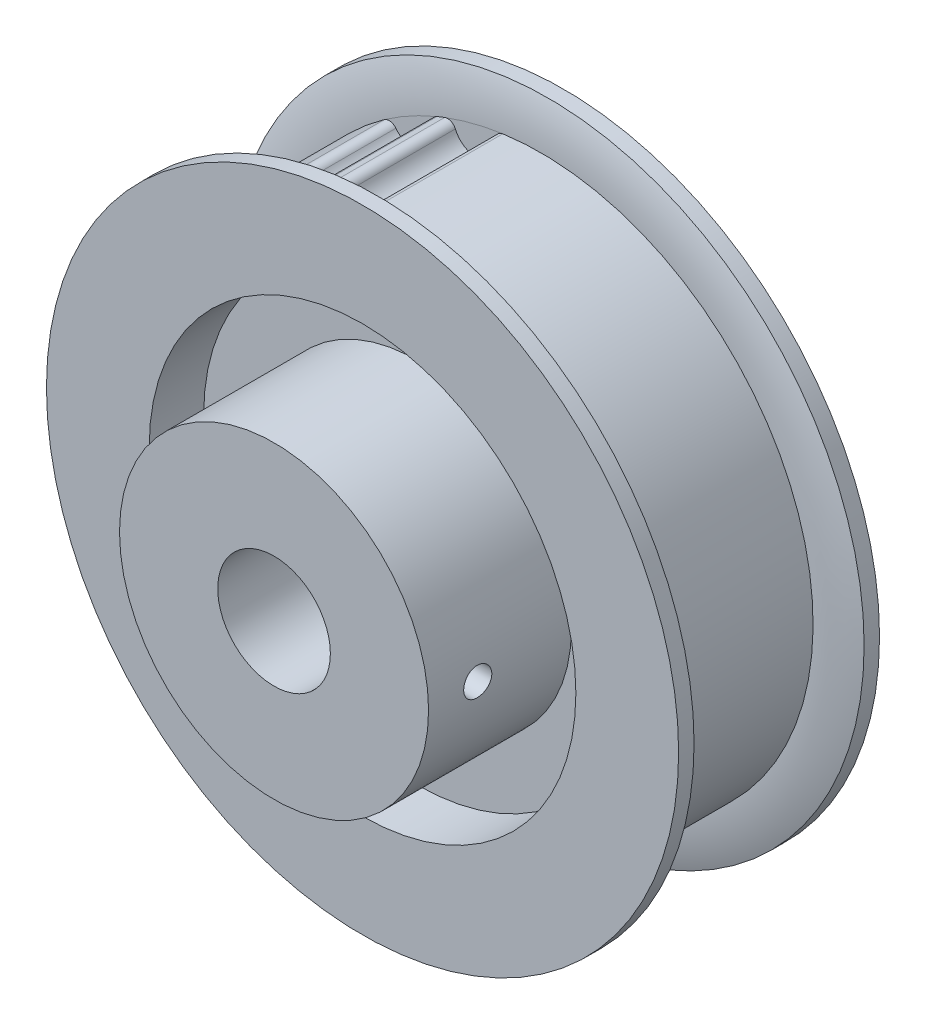
ISO-10303-21;
HEADER;
FILE_DESCRIPTION(('STEP AP214'),'2;1');
FILE_NAME('part.step','',(''),(''),'','','');
FILE_SCHEMA(('AUTOMOTIVE_DESIGN { 1 0 10303 214 1 1 1 1 }'));
ENDSEC;
DATA;
#1=APPLICATION_CONTEXT('core data for automotive mechanical design processes');
#2=APPLICATION_PROTOCOL_DEFINITION('international standard','automotive_design',2000,#1);
#3=PRODUCT_CONTEXT('',#1,'mechanical');
#4=PRODUCT('Part','Part','',(#3));
#5=PRODUCT_RELATED_PRODUCT_CATEGORY('part','',(#4));
#6=PRODUCT_DEFINITION_FORMATION('','',#4);
#7=PRODUCT_DEFINITION_CONTEXT('part definition',#1,'design');
#8=PRODUCT_DEFINITION('design','',#6,#7);
#9=PRODUCT_DEFINITION_SHAPE('','',#8);
#10=(LENGTH_UNIT() NAMED_UNIT(*) SI_UNIT(.MILLI.,.METRE.));
#11=(NAMED_UNIT(*) PLANE_ANGLE_UNIT() SI_UNIT($,.RADIAN.));
#12=(NAMED_UNIT(*) SI_UNIT($,.STERADIAN.) SOLID_ANGLE_UNIT());
#13=UNCERTAINTY_MEASURE_WITH_UNIT(LENGTH_MEASURE(1.E-05),#10,'distance_accuracy_value','');
#14=(GEOMETRIC_REPRESENTATION_CONTEXT(3) GLOBAL_UNCERTAINTY_ASSIGNED_CONTEXT((#13)) GLOBAL_UNIT_ASSIGNED_CONTEXT((#10,
#11,#12)) REPRESENTATION_CONTEXT('',''));
#15=CARTESIAN_POINT('',(0.,0.,0.));
#16=DIRECTION('',(0.,0.,1.));
#17=DIRECTION('',(1.,0.,0.));
#18=AXIS2_PLACEMENT_3D('',#15,#16,#17);
#19=CARTESIAN_POINT('',(0.,0.,-8.18));
#20=DIRECTION('',(0.,0.,1.));
#21=DIRECTION('',(1.,0.,0.));
#22=AXIS2_PLACEMENT_3D('',#19,#20,#21);
#23=CYLINDRICAL_SURFACE('',#22,4.009);
#24=CARTESIAN_POINT('',(0.,0.,-7.15));
#25=DIRECTION('',(0.,0.,1.));
#26=DIRECTION('',(1.,0.,0.));
#27=AXIS2_PLACEMENT_3D('',#24,#25,#26);
#28=CIRCLE('',#27,4.009);
#29=CARTESIAN_POINT('',(4.009,0.,-7.15));
#30=VERTEX_POINT('',#29);
#31=EDGE_CURVE('E20',#30,#30,#28,.F.);
#32=ORIENTED_EDGE('',*,*,#31,.T.);
#33=EDGE_LOOP('',(#32));
#34=FACE_BOUND('',#33,.T.);
#35=CARTESIAN_POINT('',(0.,0.,13.45));
#36=DIRECTION('',(0.,0.,1.));
#37=DIRECTION('',(1.,0.,0.));
#38=AXIS2_PLACEMENT_3D('',#35,#36,#37);
#39=CIRCLE('',#38,4.009);
#40=CARTESIAN_POINT('',(4.009,0.,13.45));
#41=VERTEX_POINT('',#40);
#42=EDGE_CURVE('E632',#41,#41,#39,.F.);
#43=ORIENTED_EDGE('',*,*,#42,.F.);
#44=EDGE_LOOP('',(#43));
#45=FACE_BOUND('',#44,.T.);
#46=CARTESIAN_POINT('',(4.009,0.,8.95));
#47=CARTESIAN_POINT('',(4.00899836550372,0.0551908520962204,8.95000282063457));
#48=CARTESIAN_POINT('',(4.00784763630519,0.110446653160701,8.95458927477763));
#49=CARTESIAN_POINT('',(4.00336384291525,0.219424046419387,8.97280195709089));
#50=CARTESIAN_POINT('',(4.00002666739113,0.273142548917412,8.98644521606377));
#51=CARTESIAN_POINT('',(3.99154021932719,0.377382395400712,9.02230722988224));
#52=CARTESIAN_POINT('',(3.98639404761028,0.42790903685331,9.04451131677123));
#53=CARTESIAN_POINT('',(3.97483915708241,0.524503614591403,9.09682153429381));
#54=CARTESIAN_POINT('',(3.96843076586231,0.570572703153768,9.12692561527033));
#55=CARTESIAN_POINT('',(3.95489840687399,0.657913993002216,9.19484073397902));
#56=CARTESIAN_POINT('',(3.9477633788263,0.69908147553429,9.23278425935317));
#57=CARTESIAN_POINT('',(3.93365522236764,0.774541554751383,9.31501931822153));
#58=CARTESIAN_POINT('',(3.92668212120812,0.808833001544661,9.35931191136136));
#59=CARTESIAN_POINT('',(3.91357717848517,0.870053064064385,9.45379240236042));
#60=CARTESIAN_POINT('',(3.90745927067669,0.896865552786396,9.50405765501213));
#61=CARTESIAN_POINT('',(3.89691749378886,0.941619508791967,9.60855890675831));
#62=CARTESIAN_POINT('',(3.89249334209781,0.959562456148547,9.66279424162416));
#63=CARTESIAN_POINT('',(3.88595285639913,0.985713549545539,9.77255259938645));
#64=CARTESIAN_POINT('',(3.88379225011952,0.994108730242365,9.82802835984838));
#65=CARTESIAN_POINT('',(3.881890961187,1.00150853719121,9.93963977605675));
#66=CARTESIAN_POINT('',(3.88214988966197,1.00051467246775,9.99577532431244));
#67=CARTESIAN_POINT('',(3.88501860770972,0.98931387699709,10.1056796612486));
#68=CARTESIAN_POINT('',(3.88757153316411,0.979329785578443,10.1594728763976));
#69=CARTESIAN_POINT('',(3.89465001309003,0.950787260078078,10.2645960028224));
#70=CARTESIAN_POINT('',(3.89917572054551,0.932228161020818,10.3159257227179));
#71=CARTESIAN_POINT('',(3.90974225148632,0.886871644677037,10.4152639110237));
#72=CARTESIAN_POINT('',(3.91579789532918,0.85999302762689,10.4632336618384));
#73=CARTESIAN_POINT('',(3.92873307577441,0.798819151386241,10.5540586700749));
#74=CARTESIAN_POINT('',(3.93561270072884,0.76452309653653,10.5969133780465));
#75=CARTESIAN_POINT('',(3.94965934057616,0.688339534501251,10.6775656283874));
#76=CARTESIAN_POINT('',(3.95682898782615,0.646265160933979,10.7151863982787));
#77=CARTESIAN_POINT('',(3.97047589904666,0.556299277081342,10.7828870581694));
#78=CARTESIAN_POINT('',(3.97695286444311,0.508405277149301,10.8129637037992));
#79=CARTESIAN_POINT('',(3.98851751482561,0.407894715285058,10.8647861073373));
#80=CARTESIAN_POINT('',(3.993599304836,0.355259325898703,10.8864966675581));
#81=CARTESIAN_POINT('',(4.00175019094036,0.246995190312301,10.9206712688926));
#82=CARTESIAN_POINT('',(4.00482347815009,0.191372941090686,10.9331545715838));
#83=CARTESIAN_POINT('',(4.00747759138432,0.112744344559036,10.9438819847958));
#84=CARTESIAN_POINT('',(4.00804709066888,0.0902637238810863,10.9461740262534));
#85=CARTESIAN_POINT('',(4.00880863009978,0.0451923663915734,10.9492336132047));
#86=CARTESIAN_POINT('',(4.00900066935511,0.0226016293202009,10.9500011550997));
#87=CARTESIAN_POINT('',(4.00899836550372,-0.0551908520962194,10.9499971793654));
#88=CARTESIAN_POINT('',(4.00784763630519,-0.1104466531607,10.9454107252224));
#89=CARTESIAN_POINT('',(4.00336384291525,-0.219424046419386,10.9271980429091));
#90=CARTESIAN_POINT('',(4.00002666739113,-0.273142548917412,10.9135547839362));
#91=CARTESIAN_POINT('',(3.99154021932719,-0.377382395400713,10.8776927701178));
#92=CARTESIAN_POINT('',(3.98639404761028,-0.42790903685331,10.8554886832288));
#93=CARTESIAN_POINT('',(3.97483915708241,-0.524503614591403,10.8031784657062));
#94=CARTESIAN_POINT('',(3.96843076586231,-0.570572703153769,10.7730743847297));
#95=CARTESIAN_POINT('',(3.95489840687399,-0.657913993002216,10.705159266021));
#96=CARTESIAN_POINT('',(3.94776337882629,-0.69908147553429,10.6672157406468));
#97=CARTESIAN_POINT('',(3.93365522236764,-0.774541554751383,10.5849806817785));
#98=CARTESIAN_POINT('',(3.92668212120812,-0.808833001544661,10.5406880886386));
#99=CARTESIAN_POINT('',(3.91357717848517,-0.870053064064385,10.4462075976396));
#100=CARTESIAN_POINT('',(3.90745927067669,-0.896865552786396,10.3959423449879));
#101=CARTESIAN_POINT('',(3.89691749378886,-0.941619508791967,10.2914410932417));
#102=CARTESIAN_POINT('',(3.89249334209781,-0.959562456148547,10.2372057583758));
#103=CARTESIAN_POINT('',(3.88595285639913,-0.985713549545539,10.1274474006135));
#104=CARTESIAN_POINT('',(3.88379225011952,-0.994108730242365,10.0719716401516));
#105=CARTESIAN_POINT('',(3.881890961187,-1.00150853719121,9.96036022394325));
#106=CARTESIAN_POINT('',(3.88214988966197,-1.00051467246775,9.90422467568755));
#107=CARTESIAN_POINT('',(3.88501860770972,-0.98931387699709,9.79432033875136));
#108=CARTESIAN_POINT('',(3.88757153316411,-0.979329785578443,9.74052712360237));
#109=CARTESIAN_POINT('',(3.89465001309003,-0.950787260078079,9.63540399717764));
#110=CARTESIAN_POINT('',(3.89917572054551,-0.932228161020818,9.5840742772821));
#111=CARTESIAN_POINT('',(3.90974225148632,-0.886871644677037,9.48473608897632));
#112=CARTESIAN_POINT('',(3.91579789532918,-0.85999302762689,9.43676633816164));
#113=CARTESIAN_POINT('',(3.92873307577441,-0.798819151386241,9.34594132992514));
#114=CARTESIAN_POINT('',(3.93561270072884,-0.76452309653653,9.30308662195345));
#115=CARTESIAN_POINT('',(3.94965934057616,-0.688339534501251,9.22243437161262));
#116=CARTESIAN_POINT('',(3.95682898782615,-0.646265160933979,9.1848136017213));
#117=CARTESIAN_POINT('',(3.97047589904666,-0.556299277081341,9.1171129418306));
#118=CARTESIAN_POINT('',(3.97695286444311,-0.508405277149301,9.08703629620081));
#119=CARTESIAN_POINT('',(3.98851751482561,-0.407894715285058,9.03521389266268));
#120=CARTESIAN_POINT('',(3.993599304836,-0.355259325898703,9.01350333244194));
#121=CARTESIAN_POINT('',(4.00175019094036,-0.2469951903123,8.97932873110735));
#122=CARTESIAN_POINT('',(4.00482347815009,-0.191372941090686,8.9668454284162));
#123=CARTESIAN_POINT('',(4.00747759138432,-0.112744344559035,8.95611801520423));
#124=CARTESIAN_POINT('',(4.00804709066888,-0.0902637238810862,8.95382597374655));
#125=CARTESIAN_POINT('',(4.00880863009978,-0.045192366391573,8.95076638679526));
#126=CARTESIAN_POINT('',(4.00900066935511,-0.0226016293202004,8.94999884490029));
#127=CARTESIAN_POINT('',(4.009,0.,8.95));
#128=B_SPLINE_CURVE_WITH_KNOTS('',3,(#46,#47,#48,#49,#50,#51,#52,#53,#54,#55,#56,#57,#58,#59,
#60,#61,#62,#63,#64,#65,#66,#67,#68,#69,#70,#71,#72,#73,#74,#75,#76,#77,#78,#79,#80,#81,#82,#83,
#84,#85,#86,#87,#88,#89,#90,#91,#92,#93,#94,#95,#96,#97,#98,#99,#100,#101,#102,#103,#104,#105,
#106,#107,#108,#109,#110,#111,#112,#113,#114,#115,#116,#117,#118,#119,#120,#121,#122,#123,#124,
#125,#126,#127),.UNSPECIFIED.,.T.,.F.,(4,2,2,2,2,2,2,2,2,2,2,2,2,2,2,2,2,2,2,2,2,2,2,2,2,2,2,2,
2,2,2,2,2,2,2,2,2,2,2,2,4),(0.,0.165485896917088,0.331283865439816,0.496799012380493,
0.662271258724692,0.830810064734122,0.999377032325899,1.17043166524782,1.34145774439516,
1.50907248457797,1.67666028587218,1.84020510988955,2.00376261862636,2.16896968634219,
2.33419448440937,2.50408040408395,2.67403925884377,2.84470555242833,3.01501457213325,
3.08278381157733,3.15055321099374,3.31603910791083,3.48183707643356,3.64735222337424,
3.81282446971844,3.98136327572787,4.14993024331964,4.32098487624157,4.49201095538891,
4.65962569557172,4.82721349686592,4.99075832088329,5.1543158296201,5.31952289733593,
5.48474769540311,5.65463361507769,5.82459246983751,5.99525876342207,6.16556778312699,
6.23333702257108,6.30110642198749),.UNSPECIFIED.);
#129=CARTESIAN_POINT('',(4.009,0.,8.95));
#130=VERTEX_POINT('',#129);
#131=EDGE_CURVE('E635',#130,#130,#128,.T.);
#132=ORIENTED_EDGE('',*,*,#131,.T.);
#133=EDGE_LOOP('',(#132));
#134=FACE_BOUND('',#133,.T.);
#135=ADVANCED_FACE('F16',(#34,#45,#134),#23,.F.);
#136=CARTESIAN_POINT('',(0.,0.,-7.15));
#137=DIRECTION('',(0.,0.,1.));
#138=DIRECTION('',(1.,0.,0.));
#139=AXIS2_PLACEMENT_3D('',#136,#137,#138);
#140=PLANE('',#139);
#141=ORIENTED_EDGE('',*,*,#31,.F.);
#142=EDGE_LOOP('',(#141));
#143=FACE_BOUND('',#142,.T.);
#144=CARTESIAN_POINT('',(0.,0.,-7.15));
#145=DIRECTION('',(0.,0.,-1.));
#146=DIRECTION('',(-1.,0.,0.));
#147=AXIS2_PLACEMENT_3D('',#144,#145,#146);
#148=CIRCLE('',#147,11.);
#149=CARTESIAN_POINT('',(-11.,0.,-7.15));
#150=VERTEX_POINT('',#149);
#151=EDGE_CURVE('E637',#150,#150,#148,.F.);
#152=ORIENTED_EDGE('',*,*,#151,.F.);
#153=EDGE_LOOP('',(#152));
#154=FACE_BOUND('',#153,.T.);
#155=ADVANCED_FACE('F606',(#143,#154),#140,.F.);
#156=CARTESIAN_POINT('',(0.,0.,13.45));
#157=DIRECTION('',(0.,0.,1.));
#158=DIRECTION('',(1.,0.,0.));
#159=AXIS2_PLACEMENT_3D('',#156,#157,#158);
#160=PLANE('',#159);
#161=ORIENTED_EDGE('',*,*,#42,.T.);
#162=EDGE_LOOP('',(#161));
#163=FACE_BOUND('',#162,.T.);
#164=CARTESIAN_POINT('',(0.,0.,13.45));
#165=DIRECTION('',(0.,0.,1.));
#166=DIRECTION('',(1.,0.,0.));
#167=AXIS2_PLACEMENT_3D('',#164,#165,#166);
#168=CIRCLE('',#167,11.);
#169=CARTESIAN_POINT('',(11.,0.,13.45));
#170=VERTEX_POINT('',#169);
#171=EDGE_CURVE('E170',#170,#170,#168,.F.);
#172=ORIENTED_EDGE('',*,*,#171,.F.);
#173=EDGE_LOOP('',(#172));
#174=FACE_BOUND('',#173,.T.);
#175=ADVANCED_FACE('F190',(#163,#174),#160,.T.);
#176=CARTESIAN_POINT('',(11.22,0.,9.95));
#177=DIRECTION('',(1.,0.,0.));
#178=DIRECTION('',(0.,0.,-1.));
#179=AXIS2_PLACEMENT_3D('',#176,#177,#178);
#180=CYLINDRICAL_SURFACE('',#179,1.);
#181=CARTESIAN_POINT('',(11.,0.,10.95));
#182=CARTESIAN_POINT('',(10.9999990618008,0.0560126496093699,10.9499954665977));
#183=CARTESIAN_POINT('',(10.9995674396925,0.112073076375414,10.9452765202687));
#184=CARTESIAN_POINT('',(10.9978854109122,0.22269272089498,10.9265074170835));
#185=CARTESIAN_POINT('',(10.9966332781448,0.27724852069916,10.9124375880333));
#186=CARTESIAN_POINT('',(10.9934520079359,0.383167343740302,10.8753788469874));
#187=CARTESIAN_POINT('',(10.9915235202305,0.434533375663347,10.8523984926046));
#188=CARTESIAN_POINT('',(10.9872059055,0.532654727732325,10.7981863161292));
#189=CARTESIAN_POINT('',(10.9848169825437,0.579412076661264,10.7669581472756));
#190=CARTESIAN_POINT('',(10.9798377834024,0.667159640349694,10.6970300166551));
#191=CARTESIAN_POINT('',(10.977246969719,0.708133582881213,10.6583096721271));
#192=CARTESIAN_POINT('',(10.9721603715182,0.783012745771742,10.5745378910209));
#193=CARTESIAN_POINT('',(10.9696645958948,0.816917305862443,10.5294858637316));
#194=CARTESIAN_POINT('',(10.9650454017585,0.876746572648426,10.4342352818317));
#195=CARTESIAN_POINT('',(10.9629226324356,0.902657424950131,10.3840279907569));
#196=CARTESIAN_POINT('',(10.9592959445208,0.945674976835949,10.2799532475713));
#197=CARTESIAN_POINT('',(10.9577920077249,0.962781935404025,10.226085903181));
#198=CARTESIAN_POINT('',(10.9555777627597,0.98766039750914,10.1163784801521));
#199=CARTESIAN_POINT('',(10.9548652607577,0.995457711611925,10.0605442996159));
#200=CARTESIAN_POINT('',(10.9543076846573,1.00157530119824,9.94835540539441));
#201=CARTESIAN_POINT('',(10.954462593006,0.999895768455735,9.89200070226554));
#202=CARTESIAN_POINT('',(10.9556203342546,0.987128672050157,9.78054842312713));
#203=CARTESIAN_POINT('',(10.9566206260902,0.97606930206751,9.72544758737241));
#204=CARTESIAN_POINT('',(10.9593524632972,0.944900127391512,9.61788693759937));
#205=CARTESIAN_POINT('',(10.9610840237171,0.924790136447161,9.56542717795595));
#206=CARTESIAN_POINT('',(10.9650862905048,0.876058370248382,9.46454715380261));
#207=CARTESIAN_POINT('',(10.9673578116427,0.847423715116364,9.41613314477831));
#208=CARTESIAN_POINT('',(10.9721830913417,0.782467376907266,9.32479178079966));
#209=CARTESIAN_POINT('',(10.9747368332432,0.746146147460724,9.28186410230395));
#210=CARTESIAN_POINT('',(10.9798498086414,0.6666968652717,9.20255309915511));
#211=CARTESIAN_POINT('',(10.9824090307129,0.623545774606622,9.16619284958842));
#212=CARTESIAN_POINT('',(10.987237477847,0.53171708951518,9.10121175815296));
#213=CARTESIAN_POINT('',(10.989506567755,0.483036939237752,9.07259451639277));
#214=CARTESIAN_POINT('',(10.993499986054,0.381499269945504,9.02391521489337));
#215=CARTESIAN_POINT('',(10.9952237910858,0.328637798187842,9.00386136779679));
#216=CARTESIAN_POINT('',(10.9979250337978,0.22036568686475,8.9729654187011));
#217=CARTESIAN_POINT('',(10.9989040550467,0.164960722962615,8.9621037665736));
#218=CARTESIAN_POINT('',(10.9998189347927,0.0728606203928066,8.95198946547373));
#219=CARTESIAN_POINT('',(11.0000006103688,0.0364404209806223,8.94999705068248));
#220=CARTESIAN_POINT('',(10.9999990618008,-0.0560126496093706,8.9500045334023));
#221=CARTESIAN_POINT('',(10.9995674396925,-0.112073076375414,8.95472347973131));
#222=CARTESIAN_POINT('',(10.9978854109122,-0.22269272089498,8.97349258291645));
#223=CARTESIAN_POINT('',(10.9966332781448,-0.277248520699161,8.98756241196671));
#224=CARTESIAN_POINT('',(10.9934520079359,-0.383167343740302,9.02462115301262));
#225=CARTESIAN_POINT('',(10.9915235202305,-0.434533375663347,9.04760150739537));
#226=CARTESIAN_POINT('',(10.9872059055,-0.532654727732325,9.10181368387078));
#227=CARTESIAN_POINT('',(10.9848169825437,-0.579412076661264,9.13304185272441));
#228=CARTESIAN_POINT('',(10.9798377834024,-0.667159640349695,9.20296998334489));
#229=CARTESIAN_POINT('',(10.977246969719,-0.708133582881214,9.2416903278729));
#230=CARTESIAN_POINT('',(10.9721603715182,-0.783012745771743,9.32546210897908));
#231=CARTESIAN_POINT('',(10.9696645958948,-0.816917305862444,9.37051413626842));
#232=CARTESIAN_POINT('',(10.9650454017585,-0.876746572648426,9.4657647181683));
#233=CARTESIAN_POINT('',(10.9629226324356,-0.902657424950131,9.51597200924306));
#234=CARTESIAN_POINT('',(10.9592959445208,-0.945674976835949,9.62004675242866));
#235=CARTESIAN_POINT('',(10.9577920077249,-0.962781935404025,9.67391409681901));
#236=CARTESIAN_POINT('',(10.9555777627597,-0.98766039750914,9.7836215198479));
#237=CARTESIAN_POINT('',(10.9548652607577,-0.995457711611925,9.83945570038413));
#238=CARTESIAN_POINT('',(10.9543076846573,-1.00157530119824,9.95164459460559));
#239=CARTESIAN_POINT('',(10.954462593006,-0.999895768455735,10.0079992977345));
#240=CARTESIAN_POINT('',(10.9556203342546,-0.987128672050157,10.1194515768729));
#241=CARTESIAN_POINT('',(10.9566206260902,-0.97606930206751,10.1745524126276));
#242=CARTESIAN_POINT('',(10.9593524632972,-0.944900127391512,10.2821130624006));
#243=CARTESIAN_POINT('',(10.9610840237171,-0.924790136447161,10.3345728220441));
#244=CARTESIAN_POINT('',(10.9650862905048,-0.876058370248382,10.4354528461974));
#245=CARTESIAN_POINT('',(10.9673578116427,-0.847423715116364,10.4838668552217));
#246=CARTESIAN_POINT('',(10.9721830913417,-0.782467376907266,10.5752082192003));
#247=CARTESIAN_POINT('',(10.9747368332432,-0.746146147460724,10.6181358976961));
#248=CARTESIAN_POINT('',(10.9798498086414,-0.6666968652717,10.6974469008449));
#249=CARTESIAN_POINT('',(10.9824090307129,-0.623545774606622,10.7338071504116));
#250=CARTESIAN_POINT('',(10.987237477847,-0.53171708951518,10.798788241847));
#251=CARTESIAN_POINT('',(10.989506567755,-0.483036939237752,10.8274054836072));
#252=CARTESIAN_POINT('',(10.993499986054,-0.381499269945504,10.8760847851066));
#253=CARTESIAN_POINT('',(10.9952237910858,-0.328637798187842,10.8961386322032));
#254=CARTESIAN_POINT('',(10.9979250337978,-0.22036568686475,10.9270345812989));
#255=CARTESIAN_POINT('',(10.9989040550467,-0.164960722962615,10.9378962334264));
#256=CARTESIAN_POINT('',(10.9998189347927,-0.0728606203928068,10.9480105345263));
#257=CARTESIAN_POINT('',(11.0000006103688,-0.0364404209806229,10.9500029493175));
#258=CARTESIAN_POINT('',(11.,0.,10.95));
#259=B_SPLINE_CURVE_WITH_KNOTS('',3,(#181,#182,#183,#184,#185,#186,#187,#188,#189,#190,#191,
#192,#193,#194,#195,#196,#197,#198,#199,#200,#201,#202,#203,#204,#205,#206,#207,#208,#209,#210,
#211,#212,#213,#214,#215,#216,#217,#218,#219,#220,#221,#222,#223,#224,#225,#226,#227,#228,#229,
#230,#231,#232,#233,#234,#235,#236,#237,#238,#239,#240,#241,#242,#243,#244,#245,#246,#247,#248,
#249,#250,#251,#252,#253,#254,#255,#256,#257,#258),.UNSPECIFIED.,.T.,.F.,(4,2,2,2,2,2,2,2,2,2,2,
2,2,2,2,2,2,2,2,2,2,2,2,2,2,2,2,2,2,2,2,2,2,2,2,2,2,2,4),(0.,0.167922295939353,
0.336198986356551,0.504314463591334,0.672355601251542,0.840860497837456,1.00938112545174,
1.17819220678412,1.34699832192048,1.51533533490065,1.68366894141662,1.85149836085627,
2.01933123418343,2.18741898364612,2.35549681601437,2.52415417583214,2.69288981859704,
2.86178692421131,3.03032390712414,3.13956992920554,3.30749222514489,3.47576891556209,
3.64388439279687,3.81192553045708,3.980430427043,4.14895105465728,4.31776213598966,
4.48656825112601,4.65490526410619,4.82323887062216,4.99106829006181,5.15890116338897,
5.32698891285165,5.49506674521991,5.66372410503767,5.83245974780258,6.00135685341684,
6.16989383632968,6.27913985841107),.UNSPECIFIED.);
#260=CARTESIAN_POINT('',(11.,0.,10.95));
#261=VERTEX_POINT('',#260);
#262=EDGE_CURVE('E163',#261,#261,#259,.T.);
#263=ORIENTED_EDGE('',*,*,#262,.F.);
#264=EDGE_LOOP('',(#263));
#265=FACE_BOUND('',#264,.T.);
#266=ORIENTED_EDGE('',*,*,#131,.F.);
#267=EDGE_LOOP('',(#266));
#268=FACE_BOUND('',#267,.T.);
#269=ADVANCED_FACE('F172',(#265,#268),#180,.F.);
#270=CARTESIAN_POINT('',(0.,0.,7.865));
#271=DIRECTION('',(0.,0.,-1.));
#272=DIRECTION('',(-1.,0.,0.));
#273=AXIS2_PLACEMENT_3D('',#270,#271,#272);
#274=CYLINDRICAL_SURFACE('',#273,11.);
#275=CARTESIAN_POINT('',(0.,0.,-3.276));
#276=DIRECTION('',(0.,0.,-1.));
#277=DIRECTION('',(-1.,0.,0.));
#278=AXIS2_PLACEMENT_3D('',#275,#276,#277);
#279=CIRCLE('',#278,11.);
#280=CARTESIAN_POINT('',(-11.,0.,-3.276));
#281=VERTEX_POINT('',#280);
#282=EDGE_CURVE('E160',#281,#281,#279,.F.);
#283=ORIENTED_EDGE('',*,*,#282,.F.);
#284=EDGE_LOOP('',(#283));
#285=FACE_BOUND('',#284,.T.);
#286=ORIENTED_EDGE('',*,*,#151,.T.);
#287=EDGE_LOOP('',(#286));
#288=FACE_BOUND('',#287,.T.);
#289=ADVANCED_FACE('F181',(#285,#288),#274,.T.);
#290=CARTESIAN_POINT('',(0.,0.,-8.18));
#291=DIRECTION('',(0.,0.,1.));
#292=DIRECTION('',(1.,0.,0.));
#293=AXIS2_PLACEMENT_3D('',#290,#291,#292);
#294=CYLINDRICAL_SURFACE('',#293,11.);
#295=CARTESIAN_POINT('',(0.,0.,3.276));
#296=DIRECTION('',(0.,0.,1.));
#297=DIRECTION('',(1.,0.,0.));
#298=AXIS2_PLACEMENT_3D('',#295,#296,#297);
#299=CIRCLE('',#298,11.);
#300=CARTESIAN_POINT('',(11.,0.,3.276));
#301=VERTEX_POINT('',#300);
#302=EDGE_CURVE('E156',#301,#301,#299,.T.);
#303=ORIENTED_EDGE('',*,*,#302,.T.);
#304=EDGE_LOOP('',(#303));
#305=FACE_BOUND('',#304,.T.);
#306=ORIENTED_EDGE('',*,*,#171,.T.);
#307=EDGE_LOOP('',(#306));
#308=FACE_BOUND('',#307,.T.);
#309=ORIENTED_EDGE('',*,*,#262,.T.);
#310=EDGE_LOOP('',(#309));
#311=FACE_BOUND('',#310,.T.);
#312=ADVANCED_FACE('F176',(#305,#308,#311),#294,.T.);
#313=CARTESIAN_POINT('',(0.,0.,-3.276));
#314=DIRECTION('',(0.,0.,-1.));
#315=DIRECTION('',(-1.,0.,0.));
#316=AXIS2_PLACEMENT_3D('',#313,#314,#315);
#317=PLANE('',#316);
#318=ORIENTED_EDGE('',*,*,#282,.T.);
#319=EDGE_LOOP('',(#318));
#320=FACE_BOUND('',#319,.T.);
#321=CARTESIAN_POINT('',(0.,0.,-3.276));
#322=DIRECTION('',(0.,0.,-1.));
#323=DIRECTION('',(-1.,0.,0.));
#324=AXIS2_PLACEMENT_3D('',#321,#322,#323);
#325=CIRCLE('',#324,15.185);
#326=CARTESIAN_POINT('',(-15.185,0.,-3.276));
#327=VERTEX_POINT('',#326);
#328=EDGE_CURVE('E152',#327,#327,#325,.T.);
#329=ORIENTED_EDGE('',*,*,#328,.T.);
#330=EDGE_LOOP('',(#329));
#331=FACE_BOUND('',#330,.T.);
#332=ADVANCED_FACE('F180',(#320,#331),#317,.T.);
#333=CARTESIAN_POINT('',(0.,0.,3.276));
#334=DIRECTION('',(0.,0.,-1.));
#335=DIRECTION('',(-1.,0.,0.));
#336=AXIS2_PLACEMENT_3D('',#333,#334,#335);
#337=PLANE('',#336);
#338=ORIENTED_EDGE('',*,*,#302,.F.);
#339=EDGE_LOOP('',(#338));
#340=FACE_BOUND('',#339,.T.);
#341=CARTESIAN_POINT('',(0.,0.,3.276));
#342=DIRECTION('',(0.,0.,-1.));
#343=DIRECTION('',(-1.,0.,0.));
#344=AXIS2_PLACEMENT_3D('',#341,#342,#343);
#345=CIRCLE('',#344,15.185);
#346=CARTESIAN_POINT('',(-15.185,0.,3.276));
#347=VERTEX_POINT('',#346);
#348=EDGE_CURVE('E147',#347,#347,#345,.F.);
#349=ORIENTED_EDGE('',*,*,#348,.T.);
#350=EDGE_LOOP('',(#349));
#351=FACE_BOUND('',#350,.T.);
#352=ADVANCED_FACE('F350',(#340,#351),#337,.F.);
#353=CARTESIAN_POINT('',(0.,0.,-8.18));
#354=DIRECTION('',(0.,0.,1.));
#355=DIRECTION('',(1.,0.,0.));
#356=AXIS2_PLACEMENT_3D('',#353,#354,#355);
#357=CYLINDRICAL_SURFACE('',#356,19.37);
#358=CARTESIAN_POINT('',(0.,0.,-5.55));
#359=DIRECTION('',(0.,0.,1.));
#360=DIRECTION('',(1.,0.,0.));
#361=AXIS2_PLACEMENT_3D('',#358,#359,#360);
#362=CIRCLE('',#361,19.37);
#363=CARTESIAN_POINT('',(-6.85743993632962,18.1155297333417,-5.55));
#364=VERTEX_POINT('',#363);
#365=CARTESIAN_POINT('',(-7.40207487382651,17.8998935070112,-5.55));
#366=VERTEX_POINT('',#365);
#367=EDGE_CURVE('E155',#364,#366,#362,.T.);
#368=ORIENTED_EDGE('',*,*,#367,.T.);
#369=DIRECTION('',(0.,0.,1.));
#370=VECTOR('',#369,1.);
#371=CARTESIAN_POINT('',(-7.40207487382728,17.8998935070131,5.55));
#372=LINE('',#371,#370);
#373=CARTESIAN_POINT('',(-7.40207487382638,17.8998935070109,5.55));
#374=VERTEX_POINT('',#373);
#375=EDGE_CURVE('E134',#374,#366,#372,.F.);
#376=ORIENTED_EDGE('',*,*,#375,.F.);
#377=CARTESIAN_POINT('',(0.,0.,5.55));
#378=DIRECTION('',(0.,0.,1.));
#379=DIRECTION('',(1.,0.,0.));
#380=AXIS2_PLACEMENT_3D('',#377,#378,#379);
#381=CIRCLE('',#380,19.37);
#382=CARTESIAN_POINT('',(-6.8574399363299,18.1155297333424,5.55));
#383=VERTEX_POINT('',#382);
#384=EDGE_CURVE('E159',#374,#383,#381,.F.);
#385=ORIENTED_EDGE('',*,*,#384,.T.);
#386=DIRECTION('',(0.,0.,1.));
#387=VECTOR('',#386,1.);
#388=CARTESIAN_POINT('',(-6.85743993633035,18.1155297333436,5.55));
#389=LINE('',#388,#387);
#390=EDGE_CURVE('E105',#364,#383,#389,.T.);
#391=ORIENTED_EDGE('',*,*,#390,.F.);
#392=EDGE_LOOP('',(#368,#376,#385,#391));
#393=FACE_BOUND('',#392,.T.);
#394=ADVANCED_FACE('F347',(#393),#357,.T.);
#395=CARTESIAN_POINT('',(0.,0.,7.865));
#396=DIRECTION('',(0.,0.,-1.));
#397=DIRECTION('',(-1.,0.,0.));
#398=AXIS2_PLACEMENT_3D('',#395,#396,#397);
#399=CYLINDRICAL_SURFACE('',#398,15.185);
#400=ORIENTED_EDGE('',*,*,#328,.F.);
#401=EDGE_LOOP('',(#400));
#402=FACE_BOUND('',#401,.T.);
#403=CARTESIAN_POINT('',(0.,0.,-7.15));
#404=DIRECTION('',(0.,0.,-1.));
#405=DIRECTION('',(-1.,0.,0.));
#406=AXIS2_PLACEMENT_3D('',#403,#404,#405);
#407=CIRCLE('',#406,15.185);
#408=CARTESIAN_POINT('',(-15.185,0.,-7.15));
#409=VERTEX_POINT('',#408);
#410=EDGE_CURVE('E131',#409,#409,#407,.T.);
#411=ORIENTED_EDGE('',*,*,#410,.T.);
#412=EDGE_LOOP('',(#411));
#413=FACE_BOUND('',#412,.T.);
#414=ADVANCED_FACE('F343',(#402,#413),#399,.F.);
#415=CARTESIAN_POINT('',(0.,0.,7.865));
#416=DIRECTION('',(0.,0.,-1.));
#417=DIRECTION('',(-1.,0.,0.));
#418=AXIS2_PLACEMENT_3D('',#415,#416,#417);
#419=CYLINDRICAL_SURFACE('',#418,15.185);
#420=ORIENTED_EDGE('',*,*,#348,.F.);
#421=EDGE_LOOP('',(#420));
#422=FACE_BOUND('',#421,.T.);
#423=CARTESIAN_POINT('',(0.,0.,7.15));
#424=DIRECTION('',(0.,0.,-1.));
#425=DIRECTION('',(-1.,0.,0.));
#426=AXIS2_PLACEMENT_3D('',#423,#424,#425);
#427=CIRCLE('',#426,15.185);
#428=CARTESIAN_POINT('',(-15.185,0.,7.15));
#429=VERTEX_POINT('',#428);
#430=EDGE_CURVE('E115',#429,#429,#427,.T.);
#431=ORIENTED_EDGE('',*,*,#430,.F.);
#432=EDGE_LOOP('',(#431));
#433=FACE_BOUND('',#432,.T.);
#434=ADVANCED_FACE('F340',(#422,#433),#419,.F.);
#435=CARTESIAN_POINT('',(-6.645223942173,17.55491160536,5.55));
#436=DIRECTION('',(0.,0.,1.));
#437=DIRECTION('',(1.,0.,0.));
#438=AXIS2_PLACEMENT_3D('',#435,#436,#437);
#439=CYLINDRICAL_SURFACE('',#438,0.59944);
#440=CARTESIAN_POINT('',(-6.645223942173,17.55491160536,-5.55));
#441=DIRECTION('',(0.,0.,1.));
#442=DIRECTION('',(1.,0.,0.));
#443=AXIS2_PLACEMENT_3D('',#440,#441,#442);
#444=CIRCLE('',#443,0.59944);
#445=CARTESIAN_POINT('',(-6.09443014146207,17.7914586465519,-5.55));
#446=VERTEX_POINT('',#445);
#447=EDGE_CURVE('E91',#446,#364,#444,.T.);
#448=ORIENTED_EDGE('',*,*,#447,.T.);
#449=ORIENTED_EDGE('',*,*,#390,.T.);
#450=CARTESIAN_POINT('',(-6.645223942173,17.55491160536,5.55));
#451=DIRECTION('',(0.,0.,1.));
#452=DIRECTION('',(1.,0.,0.));
#453=AXIS2_PLACEMENT_3D('',#450,#451,#452);
#454=CIRCLE('',#453,0.59944);
#455=CARTESIAN_POINT('',(-6.09443014146207,17.7914586465519,5.55));
#456=VERTEX_POINT('',#455);
#457=EDGE_CURVE('E106',#383,#456,#454,.F.);
#458=ORIENTED_EDGE('',*,*,#457,.T.);
#459=DIRECTION('',(0.,0.,1.));
#460=VECTOR('',#459,1.);
#461=CARTESIAN_POINT('',(-6.09443014146272,17.7914586465497,5.55));
#462=LINE('',#461,#460);
#463=EDGE_CURVE('E110',#456,#446,#462,.F.);
#464=ORIENTED_EDGE('',*,*,#463,.T.);
#465=EDGE_LOOP('',(#448,#449,#458,#464));
#466=FACE_BOUND('',#465,.T.);
#467=ADVANCED_FACE('F111',(#466),#439,.T.);
#468=CARTESIAN_POINT('',(-7.173004158248,17.34594863533,5.55));
#469=DIRECTION('',(0.,0.,1.));
#470=DIRECTION('',(1.,0.,0.));
#471=AXIS2_PLACEMENT_3D('',#468,#469,#470);
#472=CYLINDRICAL_SURFACE('',#471,0.59944);
#473=CARTESIAN_POINT('',(-7.173004158248,17.34594863533,5.55));
#474=DIRECTION('',(0.,0.,1.));
#475=DIRECTION('',(1.,0.,0.));
#476=AXIS2_PLACEMENT_3D('',#473,#474,#475);
#477=CIRCLE('',#476,0.59944);
#478=CARTESIAN_POINT('',(-7.73644315161101,17.1413397050301,5.55));
#479=VERTEX_POINT('',#478);
#480=EDGE_CURVE('E135',#479,#374,#477,.F.);
#481=ORIENTED_EDGE('',*,*,#480,.T.);
#482=ORIENTED_EDGE('',*,*,#375,.T.);
#483=CARTESIAN_POINT('',(-7.173004158248,17.34594863533,-5.55));
#484=DIRECTION('',(0.,0.,1.));
#485=DIRECTION('',(1.,0.,0.));
#486=AXIS2_PLACEMENT_3D('',#483,#484,#485);
#487=CIRCLE('',#486,0.59944);
#488=CARTESIAN_POINT('',(-7.73644315161101,17.1413397050301,-5.55));
#489=VERTEX_POINT('',#488);
#490=EDGE_CURVE('E138',#366,#489,#487,.T.);
#491=ORIENTED_EDGE('',*,*,#490,.T.);
#492=DIRECTION('',(0.,0.,1.));
#493=VECTOR('',#492,1.);
#494=CARTESIAN_POINT('',(-7.73644315161128,17.1413397050299,5.55));
#495=LINE('',#494,#493);
#496=EDGE_CURVE('E114',#489,#479,#495,.T.);
#497=ORIENTED_EDGE('',*,*,#496,.T.);
#498=EDGE_LOOP('',(#481,#482,#491,#497));
#499=FACE_BOUND('',#498,.T.);
#500=ADVANCED_FACE('F324',(#499),#472,.T.);
#501=CARTESIAN_POINT('',(0.,0.,-7.15));
#502=DIRECTION('',(0.,0.,1.));
#503=DIRECTION('',(1.,0.,0.));
#504=AXIS2_PLACEMENT_3D('',#501,#502,#503);
#505=PLANE('',#504);
#506=ORIENTED_EDGE('',*,*,#410,.F.);
#507=EDGE_LOOP('',(#506));
#508=FACE_BOUND('',#507,.T.);
#509=CARTESIAN_POINT('',(0.,0.,-7.15));
#510=DIRECTION('',(0.,0.,1.));
#511=DIRECTION('',(1.,0.,0.));
#512=AXIS2_PLACEMENT_3D('',#509,#510,#511);
#513=CIRCLE('',#512,22.5);
#514=CARTESIAN_POINT('',(22.5,0.,-7.15));
#515=VERTEX_POINT('',#514);
#516=EDGE_CURVE('E122',#515,#515,#513,.T.);
#517=ORIENTED_EDGE('',*,*,#516,.F.);
#518=EDGE_LOOP('',(#517));
#519=FACE_BOUND('',#518,.T.);
#520=ADVANCED_FACE('F321',(#508,#519),#505,.F.);
#521=CARTESIAN_POINT('',(0.,0.,7.15));
#522=DIRECTION('',(0.,0.,1.));
#523=DIRECTION('',(1.,0.,0.));
#524=AXIS2_PLACEMENT_3D('',#521,#522,#523);
#525=PLANE('',#524);
#526=ORIENTED_EDGE('',*,*,#430,.T.);
#527=EDGE_LOOP('',(#526));
#528=FACE_BOUND('',#527,.T.);
#529=CARTESIAN_POINT('',(0.,0.,7.15));
#530=DIRECTION('',(0.,0.,1.));
#531=DIRECTION('',(1.,0.,0.));
#532=AXIS2_PLACEMENT_3D('',#529,#530,#531);
#533=CIRCLE('',#532,22.5);
#534=CARTESIAN_POINT('',(22.5,0.,7.15));
#535=VERTEX_POINT('',#534);
#536=EDGE_CURVE('E305',#535,#535,#533,.F.);
#537=ORIENTED_EDGE('',*,*,#536,.F.);
#538=EDGE_LOOP('',(#537));
#539=FACE_BOUND('',#538,.T.);
#540=ADVANCED_FACE('F323',(#528,#539),#525,.T.);
#541=CARTESIAN_POINT('',(-4.533069748769,18.46200936926,5.55));
#542=DIRECTION('',(0.,0.,1.));
#543=DIRECTION('',(1.,0.,0.));
#544=AXIS2_PLACEMENT_3D('',#541,#542,#543);
#545=CYLINDRICAL_SURFACE('',#544,1.69926);
#546=CARTESIAN_POINT('',(-4.533069748769,18.46200936926,-5.55));
#547=DIRECTION('',(0.,0.,1.));
#548=DIRECTION('',(1.,0.,0.));
#549=AXIS2_PLACEMENT_3D('',#546,#547,#548);
#550=CIRCLE('',#549,1.69926);
#551=CARTESIAN_POINT('',(-4.30779359975314,16.7777483430905,-5.55));
#552=VERTEX_POINT('',#551);
#553=EDGE_CURVE('E97',#446,#552,#550,.T.);
#554=ORIENTED_EDGE('',*,*,#553,.F.);
#555=ORIENTED_EDGE('',*,*,#463,.F.);
#556=CARTESIAN_POINT('',(-4.533069748769,18.46200936926,5.55));
#557=DIRECTION('',(0.,0.,1.));
#558=DIRECTION('',(1.,0.,0.));
#559=AXIS2_PLACEMENT_3D('',#556,#557,#558);
#560=CIRCLE('',#559,1.69926);
#561=CARTESIAN_POINT('',(-4.30779359975314,16.7777483430905,5.55));
#562=VERTEX_POINT('',#561);
#563=EDGE_CURVE('E303',#456,#562,#560,.T.);
#564=ORIENTED_EDGE('',*,*,#563,.T.);
#565=DIRECTION('',(0.,0.,1.));
#566=VECTOR('',#565,1.);
#567=CARTESIAN_POINT('',(-4.30779359974015,16.7777483430955,5.55));
#568=LINE('',#567,#566);
#569=EDGE_CURVE('E119',#562,#552,#568,.F.);
#570=ORIENTED_EDGE('',*,*,#569,.T.);
#571=EDGE_LOOP('',(#554,#555,#564,#570));
#572=FACE_BOUND('',#571,.T.);
#573=ADVANCED_FACE('F117',(#572),#545,.F.);
#574=CARTESIAN_POINT('',(-9.333649450593,16.56132540685,5.55));
#575=DIRECTION('',(0.,0.,1.));
#576=DIRECTION('',(1.,0.,0.));
#577=AXIS2_PLACEMENT_3D('',#574,#575,#576);
#578=CYLINDRICAL_SURFACE('',#577,1.69926);
#579=CARTESIAN_POINT('',(-9.333649450593,16.56132540685,-5.55));
#580=DIRECTION('',(0.,0.,1.));
#581=DIRECTION('',(1.,0.,0.));
#582=AXIS2_PLACEMENT_3D('',#579,#580,#581);
#583=CIRCLE('',#582,1.69926);
#584=CARTESIAN_POINT('',(-8.34491268464885,15.1793398225289,-5.55));
#585=VERTEX_POINT('',#584);
#586=EDGE_CURVE('E254',#585,#489,#583,.T.);
#587=ORIENTED_EDGE('',*,*,#586,.F.);
#588=DIRECTION('',(0.,0.,1.));
#589=VECTOR('',#588,1.);
#590=CARTESIAN_POINT('',(-8.34491268464775,15.1793398225294,5.55));
#591=LINE('',#590,#589);
#592=CARTESIAN_POINT('',(-8.34491268464885,15.1793398225289,5.55));
#593=VERTEX_POINT('',#592);
#594=EDGE_CURVE('E249',#585,#593,#591,.T.);
#595=ORIENTED_EDGE('',*,*,#594,.T.);
#596=CARTESIAN_POINT('',(-9.333649450593,16.56132540685,5.55));
#597=DIRECTION('',(0.,0.,1.));
#598=DIRECTION('',(1.,0.,0.));
#599=AXIS2_PLACEMENT_3D('',#596,#597,#598);
#600=CIRCLE('',#599,1.69926);
#601=EDGE_CURVE('E294',#593,#479,#600,.T.);
#602=ORIENTED_EDGE('',*,*,#601,.T.);
#603=ORIENTED_EDGE('',*,*,#496,.F.);
#604=EDGE_LOOP('',(#587,#595,#602,#603));
#605=FACE_BOUND('',#604,.T.);
#606=ADVANCED_FACE('F384',(#605),#578,.F.);
#607=CARTESIAN_POINT('',(0.,0.,-5.55));
#608=DIRECTION('',(0.,0.,1.));
#609=DIRECTION('',(1.,0.,0.));
#610=AXIS2_PLACEMENT_3D('',#607,#608,#609);
#611=PLANE('',#610);
#612=CARTESIAN_POINT('',(-2.633889033498,18.58484735673,-5.55));
#613=DIRECTION('',(0.,0.,1.));
#614=DIRECTION('',(1.,0.,0.));
#615=AXIS2_PLACEMENT_3D('',#612,#613,#614);
#616=CIRCLE('',#615,0.59944);
#617=CARTESIAN_POINT('',(-3.23051072658114,18.5267881719044,-5.55));
#618=VERTEX_POINT('',#617);
#619=CARTESIAN_POINT('',(-2.71800258313203,19.1783566021202,-5.55));
#620=VERTEX_POINT('',#619);
#621=EDGE_CURVE('E120',#618,#620,#616,.F.);
#622=ORIENTED_EDGE('',*,*,#621,.T.);
#623=CARTESIAN_POINT('',(0.,0.,-5.55));
#624=DIRECTION('',(0.,0.,-1.));
#625=DIRECTION('',(-0.354023744776977,0.935236434349136,0.));
#626=AXIS2_PLACEMENT_3D('',#623,#624,#625);
#627=CIRCLE('',#626,19.369999999997);
#628=EDGE_CURVE('E100',#364,#620,#627,.T.);
#629=ORIENTED_EDGE('',*,*,#628,.F.);
#630=ORIENTED_EDGE('',*,*,#447,.F.);
#631=ORIENTED_EDGE('',*,*,#553,.T.);
#632=CARTESIAN_POINT('',(-4.921781542993,18.36220514375,-5.55));
#633=DIRECTION('',(0.,0.,1.));
#634=DIRECTION('',(1.,0.,0.));
#635=AXIS2_PLACEMENT_3D('',#632,#633,#634);
#636=CIRCLE('',#635,1.69926);
#637=EDGE_CURVE('E253',#552,#618,#636,.T.);
#638=ORIENTED_EDGE('',*,*,#637,.T.);
#639=EDGE_LOOP('',(#622,#629,#630,#631,#638));
#640=FACE_BOUND('',#639,.T.);
#641=ADVANCED_FACE('F94',(#640),#611,.T.);
#642=CARTESIAN_POINT('',(0.,0.,-8.18));
#643=DIRECTION('',(0.,0.,1.));
#644=DIRECTION('',(1.,0.,0.));
#645=AXIS2_PLACEMENT_3D('',#642,#643,#644);
#646=CYLINDRICAL_SURFACE('',#645,22.5);
#647=ORIENTED_EDGE('',*,*,#516,.T.);
#648=EDGE_LOOP('',(#647));
#649=FACE_BOUND('',#648,.T.);
#650=CARTESIAN_POINT('',(0.,0.,-6.05246874182563));
#651=DIRECTION('',(0.,0.,-1.));
#652=DIRECTION('',(0.,-1.,0.));
#653=AXIS2_PLACEMENT_3D('',#650,#651,#652);
#654=CIRCLE('',#653,22.5000000000001);
#655=CARTESIAN_POINT('',(0.,-22.5000000000001,-6.05246874182563));
#656=VERTEX_POINT('',#655);
#657=EDGE_CURVE('E263',#656,#656,#654,.F.);
#658=ORIENTED_EDGE('',*,*,#657,.F.);
#659=EDGE_LOOP('',(#658));
#660=FACE_BOUND('',#659,.T.);
#661=ADVANCED_FACE('F318',(#649,#660),#646,.T.);
#662=CARTESIAN_POINT('',(0.,0.,-5.55));
#663=DIRECTION('',(0.,0.,1.));
#664=DIRECTION('',(1.,0.,0.));
#665=AXIS2_PLACEMENT_3D('',#662,#663,#664);
#666=PLANE('',#665);
#667=ORIENTED_EDGE('',*,*,#490,.F.);
#668=CARTESIAN_POINT('',(0.,0.,-5.55));
#669=DIRECTION('',(0.,0.,-1.));
#670=DIRECTION('',(-0.575485281156265,0.817812136845923,0.));
#671=AXIS2_PLACEMENT_3D('',#668,#669,#670);
#672=CIRCLE('',#671,19.3700000000026);
#673=CARTESIAN_POINT('',(-11.1471498959981,15.8410210907073,-5.55));
#674=VERTEX_POINT('',#673);
#675=EDGE_CURVE('E266',#674,#366,#672,.T.);
#676=ORIENTED_EDGE('',*,*,#675,.F.);
#677=CARTESIAN_POINT('',(-10.80218099864,15.35079178369,-5.55));
#678=DIRECTION('',(0.,0.,1.));
#679=DIRECTION('',(1.,0.,0.));
#680=AXIS2_PLACEMENT_3D('',#677,#678,#679);
#681=CIRCLE('',#680,0.59944);
#682=CARTESIAN_POINT('',(-10.3275182549997,15.7168841127545,-5.55));
#683=VERTEX_POINT('',#682);
#684=EDGE_CURVE('E311',#674,#683,#681,.F.);
#685=ORIENTED_EDGE('',*,*,#684,.T.);
#686=CARTESIAN_POINT('',(-8.981970053758,16.75466279134,-5.55));
#687=DIRECTION('',(0.,0.,1.));
#688=DIRECTION('',(1.,0.,0.));
#689=AXIS2_PLACEMENT_3D('',#686,#687,#688);
#690=CIRCLE('',#689,1.69926);
#691=EDGE_CURVE('E251',#683,#585,#690,.T.);
#692=ORIENTED_EDGE('',*,*,#691,.T.);
#693=ORIENTED_EDGE('',*,*,#586,.T.);
#694=EDGE_LOOP('',(#667,#676,#685,#692,#693));
#695=FACE_BOUND('',#694,.T.);
#696=ADVANCED_FACE('F413',(#695),#666,.T.);
#697=CARTESIAN_POINT('',(-4.921781542993,18.36220514375,5.55));
#698=DIRECTION('',(0.,0.,1.));
#699=DIRECTION('',(1.,0.,0.));
#700=AXIS2_PLACEMENT_3D('',#697,#698,#699);
#701=CYLINDRICAL_SURFACE('',#700,1.69926);
#702=ORIENTED_EDGE('',*,*,#637,.F.);
#703=ORIENTED_EDGE('',*,*,#569,.F.);
#704=CARTESIAN_POINT('',(-4.921781542993,18.36220514375,5.55));
#705=DIRECTION('',(0.,0.,1.));
#706=DIRECTION('',(1.,0.,0.));
#707=AXIS2_PLACEMENT_3D('',#704,#705,#706);
#708=CIRCLE('',#707,1.69926);
#709=CARTESIAN_POINT('',(-3.23051072658157,18.5267881719044,5.55));
#710=VERTEX_POINT('',#709);
#711=EDGE_CURVE('E299',#562,#710,#708,.T.);
#712=ORIENTED_EDGE('',*,*,#711,.T.);
#713=DIRECTION('',(0.,0.,1.));
#714=VECTOR('',#713,1.);
#715=CARTESIAN_POINT('',(-3.23051072658072,18.5267881719001,5.55));
#716=LINE('',#715,#714);
#717=EDGE_CURVE('E286',#618,#710,#716,.T.);
#718=ORIENTED_EDGE('',*,*,#717,.F.);
#719=EDGE_LOOP('',(#702,#703,#712,#718));
#720=FACE_BOUND('',#719,.T.);
#721=ADVANCED_FACE('F370',(#720),#701,.F.);
#722=CARTESIAN_POINT('',(0.,0.,-8.18));
#723=DIRECTION('',(0.,0.,1.));
#724=DIRECTION('',(1.,0.,0.));
#725=AXIS2_PLACEMENT_3D('',#722,#723,#724);
#726=CYLINDRICAL_SURFACE('',#725,22.5);
#727=ORIENTED_EDGE('',*,*,#536,.T.);
#728=EDGE_LOOP('',(#727));
#729=FACE_BOUND('',#728,.T.);
#730=CARTESIAN_POINT('',(0.,0.,6.05246874182563));
#731=DIRECTION('',(0.,0.,-1.));
#732=DIRECTION('',(0.,-1.,0.));
#733=AXIS2_PLACEMENT_3D('',#730,#731,#732);
#734=CIRCLE('',#733,22.5000000000001);
#735=CARTESIAN_POINT('',(0.,-22.5000000000001,6.05246874182563));
#736=VERTEX_POINT('',#735);
#737=EDGE_CURVE('E256',#736,#736,#734,.T.);
#738=ORIENTED_EDGE('',*,*,#737,.F.);
#739=EDGE_LOOP('',(#738));
#740=FACE_BOUND('',#739,.T.);
#741=ADVANCED_FACE('F366',(#729,#740),#726,.T.);
#742=CARTESIAN_POINT('',(0.,0.,5.55));
#743=DIRECTION('',(0.,0.,1.));
#744=DIRECTION('',(1.,0.,0.));
#745=AXIS2_PLACEMENT_3D('',#742,#743,#744);
#746=PLANE('',#745);
#747=ORIENTED_EDGE('',*,*,#711,.F.);
#748=ORIENTED_EDGE('',*,*,#563,.F.);
#749=ORIENTED_EDGE('',*,*,#457,.F.);
#750=CARTESIAN_POINT('',(0.,0.,5.55));
#751=DIRECTION('',(0.,0.,1.));
#752=DIRECTION('',(-0.14032021595932,0.990106174606102,0.));
#753=AXIS2_PLACEMENT_3D('',#750,#751,#752);
#754=CIRCLE('',#753,19.3700000000017);
#755=CARTESIAN_POINT('',(-2.71800258313214,19.178356602121,5.55));
#756=VERTEX_POINT('',#755);
#757=EDGE_CURVE('E259',#756,#383,#754,.T.);
#758=ORIENTED_EDGE('',*,*,#757,.F.);
#759=CARTESIAN_POINT('',(-2.633889033498,18.58484735673,5.55));
#760=DIRECTION('',(0.,0.,1.));
#761=DIRECTION('',(1.,0.,0.));
#762=AXIS2_PLACEMENT_3D('',#759,#760,#761);
#763=CIRCLE('',#762,0.59944);
#764=EDGE_CURVE('E260',#710,#756,#763,.F.);
#765=ORIENTED_EDGE('',*,*,#764,.F.);
#766=EDGE_LOOP('',(#747,#748,#749,#758,#765));
#767=FACE_BOUND('',#766,.T.);
#768=ADVANCED_FACE('F369',(#767),#746,.F.);
#769=CARTESIAN_POINT('',(0.,0.,5.55));
#770=DIRECTION('',(0.,0.,1.));
#771=DIRECTION('',(1.,0.,0.));
#772=AXIS2_PLACEMENT_3D('',#769,#770,#771);
#773=PLANE('',#772);
#774=ORIENTED_EDGE('',*,*,#601,.F.);
#775=CARTESIAN_POINT('',(-8.981970053758,16.75466279134,5.55));
#776=DIRECTION('',(0.,0.,1.));
#777=DIRECTION('',(1.,0.,0.));
#778=AXIS2_PLACEMENT_3D('',#775,#776,#777);
#779=CIRCLE('',#778,1.69926);
#780=CARTESIAN_POINT('',(-10.3275182549997,15.7168841127545,5.55));
#781=VERTEX_POINT('',#780);
#782=EDGE_CURVE('E291',#593,#781,#779,.F.);
#783=ORIENTED_EDGE('',*,*,#782,.T.);
#784=CARTESIAN_POINT('',(-10.80218099864,15.35079178369,5.55));
#785=DIRECTION('',(0.,0.,1.));
#786=DIRECTION('',(1.,0.,0.));
#787=AXIS2_PLACEMENT_3D('',#784,#785,#786);
#788=CIRCLE('',#787,0.59944);
#789=CARTESIAN_POINT('',(-11.1471498959979,15.8410210907071,5.55));
#790=VERTEX_POINT('',#789);
#791=EDGE_CURVE('E297',#790,#781,#788,.F.);
#792=ORIENTED_EDGE('',*,*,#791,.F.);
#793=CARTESIAN_POINT('',(0.,0.,5.55));
#794=DIRECTION('',(0.,0.,1.));
#795=DIRECTION('',(-0.382141191214546,0.924103949768168,0.));
#796=AXIS2_PLACEMENT_3D('',#793,#794,#795);
#797=CIRCLE('',#796,19.3700000000006);
#798=EDGE_CURVE('E248',#374,#790,#797,.T.);
#799=ORIENTED_EDGE('',*,*,#798,.F.);
#800=ORIENTED_EDGE('',*,*,#480,.F.);
#801=EDGE_LOOP('',(#774,#783,#792,#799,#800));
#802=FACE_BOUND('',#801,.T.);
#803=ADVANCED_FACE('F381',(#802),#773,.F.);
#804=CARTESIAN_POINT('',(-8.981970053758,16.75466279134,5.55));
#805=DIRECTION('',(0.,0.,1.));
#806=DIRECTION('',(1.,0.,0.));
#807=AXIS2_PLACEMENT_3D('',#804,#805,#806);
#808=CYLINDRICAL_SURFACE('',#807,1.69926);
#809=ORIENTED_EDGE('',*,*,#691,.F.);
#810=DIRECTION('',(0.,0.,1.));
#811=VECTOR('',#810,1.);
#812=CARTESIAN_POINT('',(-10.3275182549976,15.7168841127518,5.55));
#813=LINE('',#812,#811);
#814=EDGE_CURVE('E239',#781,#683,#813,.F.);
#815=ORIENTED_EDGE('',*,*,#814,.F.);
#816=ORIENTED_EDGE('',*,*,#782,.F.);
#817=ORIENTED_EDGE('',*,*,#594,.F.);
#818=EDGE_LOOP('',(#809,#815,#816,#817));
#819=FACE_BOUND('',#818,.T.);
#820=ADVANCED_FACE('F224',(#819),#808,.F.);
#821=CARTESIAN_POINT('',(0.,0.,-15.55));
#822=DIRECTION('',(0.,0.,-1.));
#823=DIRECTION('',(0.,-1.,0.));
#824=AXIS2_PLACEMENT_3D('',#821,#822,#823);
#825=TOROIDAL_SURFACE('',#824,19.37,10.);
#826=ORIENTED_EDGE('',*,*,#657,.T.);
#827=EDGE_LOOP('',(#826));
#828=FACE_BOUND('',#827,.T.);
#829=CARTESIAN_POINT('',(0.,0.,-5.55));
#830=DIRECTION('',(0.,0.,1.));
#831=DIRECTION('',(1.,0.,0.));
#832=AXIS2_PLACEMENT_3D('',#829,#830,#831);
#833=CIRCLE('',#832,19.37);
#834=EDGE_CURVE('E247',#674,#620,#833,.T.);
#835=ORIENTED_EDGE('',*,*,#834,.F.);
#836=ORIENTED_EDGE('',*,*,#675,.T.);
#837=ORIENTED_EDGE('',*,*,#367,.F.);
#838=ORIENTED_EDGE('',*,*,#628,.T.);
#839=EDGE_LOOP('',(#835,#836,#837,#838));
#840=FACE_BOUND('',#839,.T.);
#841=ADVANCED_FACE('F220',(#828,#840),#825,.T.);
#842=CARTESIAN_POINT('',(-2.633889033498,18.58484735673,5.55));
#843=DIRECTION('',(0.,0.,1.));
#844=DIRECTION('',(1.,0.,0.));
#845=AXIS2_PLACEMENT_3D('',#842,#843,#844);
#846=CYLINDRICAL_SURFACE('',#845,0.59944);
#847=ORIENTED_EDGE('',*,*,#764,.T.);
#848=DIRECTION('',(0.,0.,1.));
#849=VECTOR('',#848,1.);
#850=CARTESIAN_POINT('',(-2.71800258313203,19.1783566021202,-8.18));
#851=LINE('',#850,#849);
#852=EDGE_CURVE('E393',#620,#756,#851,.T.);
#853=ORIENTED_EDGE('',*,*,#852,.F.);
#854=ORIENTED_EDGE('',*,*,#621,.F.);
#855=ORIENTED_EDGE('',*,*,#717,.T.);
#856=EDGE_LOOP('',(#847,#853,#854,#855));
#857=FACE_BOUND('',#856,.T.);
#858=ADVANCED_FACE('F209',(#857),#846,.T.);
#859=CARTESIAN_POINT('',(0.,0.,15.55));
#860=DIRECTION('',(0.,0.,-1.));
#861=DIRECTION('',(0.,-1.,0.));
#862=AXIS2_PLACEMENT_3D('',#859,#860,#861);
#863=TOROIDAL_SURFACE('',#862,19.37,10.);
#864=ORIENTED_EDGE('',*,*,#737,.T.);
#865=EDGE_LOOP('',(#864));
#866=FACE_BOUND('',#865,.T.);
#867=ORIENTED_EDGE('',*,*,#384,.F.);
#868=ORIENTED_EDGE('',*,*,#798,.T.);
#869=CARTESIAN_POINT('',(0.,0.,5.55));
#870=DIRECTION('',(0.,0.,1.));
#871=DIRECTION('',(1.,0.,0.));
#872=AXIS2_PLACEMENT_3D('',#869,#870,#871);
#873=CIRCLE('',#872,19.37);
#874=EDGE_CURVE('E26',#756,#790,#873,.F.);
#875=ORIENTED_EDGE('',*,*,#874,.F.);
#876=ORIENTED_EDGE('',*,*,#757,.T.);
#877=EDGE_LOOP('',(#867,#868,#875,#876));
#878=FACE_BOUND('',#877,.T.);
#879=ADVANCED_FACE('F201',(#866,#878),#863,.T.);
#880=CARTESIAN_POINT('',(-10.80218099864,15.35079178369,5.55));
#881=DIRECTION('',(0.,0.,1.));
#882=DIRECTION('',(1.,0.,0.));
#883=AXIS2_PLACEMENT_3D('',#880,#881,#882);
#884=CYLINDRICAL_SURFACE('',#883,0.59944);
#885=ORIENTED_EDGE('',*,*,#684,.F.);
#886=DIRECTION('',(0.,0.,1.));
#887=VECTOR('',#886,1.);
#888=CARTESIAN_POINT('',(-11.1471498959969,15.8410210907055,-8.18));
#889=LINE('',#888,#887);
#890=EDGE_CURVE('E10',#790,#674,#889,.F.);
#891=ORIENTED_EDGE('',*,*,#890,.F.);
#892=ORIENTED_EDGE('',*,*,#791,.T.);
#893=ORIENTED_EDGE('',*,*,#814,.T.);
#894=EDGE_LOOP('',(#885,#891,#892,#893));
#895=FACE_BOUND('',#894,.T.);
#896=ADVANCED_FACE('F196',(#895),#884,.T.);
#897=CARTESIAN_POINT('',(0.,0.,-8.18));
#898=DIRECTION('',(0.,0.,1.));
#899=DIRECTION('',(1.,0.,0.));
#900=AXIS2_PLACEMENT_3D('',#897,#898,#899);
#901=CYLINDRICAL_SURFACE('',#900,19.37);
#902=ORIENTED_EDGE('',*,*,#874,.T.);
#903=ORIENTED_EDGE('',*,*,#890,.T.);
#904=ORIENTED_EDGE('',*,*,#834,.T.);
#905=ORIENTED_EDGE('',*,*,#852,.T.);
#906=EDGE_LOOP('',(#902,#903,#904,#905));
#907=FACE_BOUND('',#906,.T.);
#908=ADVANCED_FACE('F194',(#907),#901,.T.);
#909=CLOSED_SHELL('',(#135,#155,#175,#269,#289,#312,#332,#352,#394,#414,#434,#467,#500,#520,
#540,#573,#606,#641,#661,#696,#721,#741,#768,#803,#820,#841,#858,#879,#896,#908));
#910=MANIFOLD_SOLID_BREP('B1',#909);
#911=ADVANCED_BREP_SHAPE_REPRESENTATION('',(#18,#910),#14);
#912=SHAPE_DEFINITION_REPRESENTATION(#9,#911);
ENDSEC;
END-ISO-10303-21;
